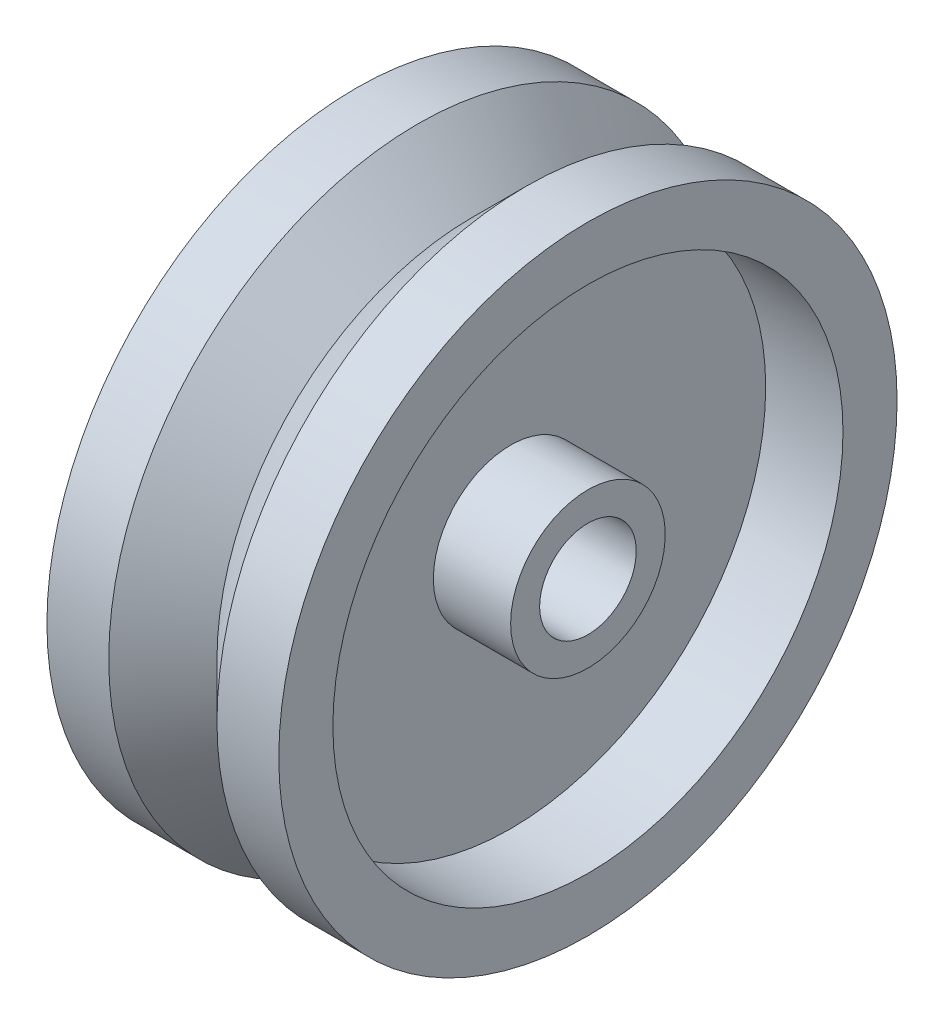
ISO-10303-21;
HEADER;
FILE_DESCRIPTION(('STEP AP214'),'2;1');
FILE_NAME('part.step','',(''),(''),'','','');
FILE_SCHEMA(('AUTOMOTIVE_DESIGN { 1 0 10303 214 1 1 1 1 }'));
ENDSEC;
DATA;
#1=APPLICATION_CONTEXT('core data for automotive mechanical design processes');
#2=APPLICATION_PROTOCOL_DEFINITION('international standard','automotive_design',2000,#1);
#3=PRODUCT_CONTEXT('',#1,'mechanical');
#4=PRODUCT('Part','Part','',(#3));
#5=PRODUCT_RELATED_PRODUCT_CATEGORY('part','',(#4));
#6=PRODUCT_DEFINITION_FORMATION('','',#4);
#7=PRODUCT_DEFINITION_CONTEXT('part definition',#1,'design');
#8=PRODUCT_DEFINITION('design','',#6,#7);
#9=PRODUCT_DEFINITION_SHAPE('','',#8);
#10=(LENGTH_UNIT() NAMED_UNIT(*) SI_UNIT(.MILLI.,.METRE.));
#11=(NAMED_UNIT(*) PLANE_ANGLE_UNIT() SI_UNIT($,.RADIAN.));
#12=(NAMED_UNIT(*) SI_UNIT($,.STERADIAN.) SOLID_ANGLE_UNIT());
#13=UNCERTAINTY_MEASURE_WITH_UNIT(LENGTH_MEASURE(1.E-05),#10,'distance_accuracy_value','');
#14=(GEOMETRIC_REPRESENTATION_CONTEXT(3) GLOBAL_UNCERTAINTY_ASSIGNED_CONTEXT((#13)) GLOBAL_UNIT_ASSIGNED_CONTEXT((#10,
#11,#12)) REPRESENTATION_CONTEXT('',''));
#15=CARTESIAN_POINT('',(0.,0.,0.));
#16=DIRECTION('',(0.,0.,1.));
#17=DIRECTION('',(1.,0.,0.));
#18=AXIS2_PLACEMENT_3D('',#15,#16,#17);
#19=CARTESIAN_POINT('',(0.,0.,6.47515527950311));
#20=DIRECTION('',(-1.,0.,0.));
#21=DIRECTION('',(0.,0.,1.));
#22=AXIS2_PLACEMENT_3D('',#19,#20,#21);
#23=PLANE('',#22);
#24=CARTESIAN_POINT('',(0.,0.,3.35015527950311));
#25=DIRECTION('',(-1.,0.,0.));
#26=DIRECTION('',(0.,0.,1.));
#27=AXIS2_PLACEMENT_3D('',#24,#25,#26);
#28=CIRCLE('',#27,5.);
#29=CARTESIAN_POINT('',(0.,0.,8.35015527950311));
#30=VERTEX_POINT('',#29);
#31=EDGE_CURVE('E10',#30,#30,#28,.T.);
#32=ORIENTED_EDGE('',*,*,#31,.T.);
#33=EDGE_LOOP('',(#32));
#34=FACE_BOUND('',#33,.T.);
#35=CARTESIAN_POINT('',(0.,0.,3.35015527950311));
#36=DIRECTION('',(-1.,0.,0.));
#37=DIRECTION('',(0.,0.,1.));
#38=AXIS2_PLACEMENT_3D('',#35,#36,#37);
#39=CIRCLE('',#38,3.125);
#40=CARTESIAN_POINT('',(0.,0.,6.47515527950311));
#41=VERTEX_POINT('',#40);
#42=EDGE_CURVE('E104',#41,#41,#39,.T.);
#43=ORIENTED_EDGE('',*,*,#42,.F.);
#44=EDGE_LOOP('',(#43));
#45=FACE_BOUND('',#44,.T.);
#46=ADVANCED_FACE('F41',(#34,#45),#23,.T.);
#47=CARTESIAN_POINT('',(-0.838509316770183,0.,3.35015527950311));
#48=DIRECTION('',(-1.,0.,0.));
#49=DIRECTION('',(0.,0.,1.));
#50=AXIS2_PLACEMENT_3D('',#47,#48,#49);
#51=CYLINDRICAL_SURFACE('',#50,5.);
#52=CARTESIAN_POINT('',(5.,0.,3.35015527950311));
#53=DIRECTION('',(-1.,0.,0.));
#54=DIRECTION('',(0.,0.,1.));
#55=AXIS2_PLACEMENT_3D('',#52,#53,#54);
#56=CIRCLE('',#55,5.);
#57=CARTESIAN_POINT('',(5.,0.,8.35015527950311));
#58=VERTEX_POINT('',#57);
#59=EDGE_CURVE('E48',#58,#58,#56,.T.);
#60=ORIENTED_EDGE('',*,*,#59,.T.);
#61=EDGE_LOOP('',(#60));
#62=FACE_BOUND('',#61,.T.);
#63=ORIENTED_EDGE('',*,*,#31,.F.);
#64=EDGE_LOOP('',(#63));
#65=FACE_BOUND('',#64,.T.);
#66=ADVANCED_FACE('F113',(#62,#65),#51,.T.);
#67=CARTESIAN_POINT('',(5.,0.,8.35015527950311));
#68=DIRECTION('',(-1.,0.,0.));
#69=DIRECTION('',(0.,0.,1.));
#70=AXIS2_PLACEMENT_3D('',#67,#68,#69);
#71=PLANE('',#70);
#72=CARTESIAN_POINT('',(5.,0.,3.35015527950311));
#73=DIRECTION('',(-1.,0.,0.));
#74=DIRECTION('',(0.,0.,1.));
#75=AXIS2_PLACEMENT_3D('',#72,#73,#74);
#76=CIRCLE('',#75,16.5);
#77=CARTESIAN_POINT('',(5.,0.,19.8501552795031));
#78=VERTEX_POINT('',#77);
#79=EDGE_CURVE('E53',#78,#78,#76,.T.);
#80=ORIENTED_EDGE('',*,*,#79,.T.);
#81=EDGE_LOOP('',(#80));
#82=FACE_BOUND('',#81,.T.);
#83=ORIENTED_EDGE('',*,*,#59,.F.);
#84=EDGE_LOOP('',(#83));
#85=FACE_BOUND('',#84,.T.);
#86=ADVANCED_FACE('F117',(#82,#85),#71,.T.);
#87=CARTESIAN_POINT('',(-0.838509316770183,0.,3.35015527950311));
#88=DIRECTION('',(-1.,0.,0.));
#89=DIRECTION('',(0.,0.,1.));
#90=AXIS2_PLACEMENT_3D('',#87,#88,#89);
#91=CYLINDRICAL_SURFACE('',#90,16.5);
#92=CARTESIAN_POINT('',(0.,0.,3.35015527950311));
#93=DIRECTION('',(-1.,0.,0.));
#94=DIRECTION('',(0.,0.,1.));
#95=AXIS2_PLACEMENT_3D('',#92,#93,#94);
#96=CIRCLE('',#95,16.5);
#97=CARTESIAN_POINT('',(0.,0.,19.8501552795031));
#98=VERTEX_POINT('',#97);
#99=EDGE_CURVE('E58',#98,#98,#96,.T.);
#100=ORIENTED_EDGE('',*,*,#99,.T.);
#101=EDGE_LOOP('',(#100));
#102=FACE_BOUND('',#101,.T.);
#103=ORIENTED_EDGE('',*,*,#79,.F.);
#104=EDGE_LOOP('',(#103));
#105=FACE_BOUND('',#104,.T.);
#106=ADVANCED_FACE('F121',(#102,#105),#91,.F.);
#107=CARTESIAN_POINT('',(0.,0.,19.8501552795031));
#108=DIRECTION('',(-1.,0.,0.));
#109=DIRECTION('',(0.,0.,1.));
#110=AXIS2_PLACEMENT_3D('',#107,#108,#109);
#111=PLANE('',#110);
#112=CARTESIAN_POINT('',(0.,0.,3.35015527950311));
#113=DIRECTION('',(-1.,0.,0.));
#114=DIRECTION('',(0.,0.,1.));
#115=AXIS2_PLACEMENT_3D('',#112,#113,#114);
#116=CIRCLE('',#115,20.);
#117=CARTESIAN_POINT('',(0.,0.,23.3501552795031));
#118=VERTEX_POINT('',#117);
#119=EDGE_CURVE('E64',#118,#118,#116,.T.);
#120=ORIENTED_EDGE('',*,*,#119,.T.);
#121=EDGE_LOOP('',(#120));
#122=FACE_BOUND('',#121,.T.);
#123=ORIENTED_EDGE('',*,*,#99,.F.);
#124=EDGE_LOOP('',(#123));
#125=FACE_BOUND('',#124,.T.);
#126=ADVANCED_FACE('F128',(#122,#125),#111,.T.);
#127=CARTESIAN_POINT('',(-0.838509316770183,0.,3.35015527950311));
#128=DIRECTION('',(-1.,0.,0.));
#129=DIRECTION('',(0.,0.,1.));
#130=AXIS2_PLACEMENT_3D('',#127,#128,#129);
#131=CYLINDRICAL_SURFACE('',#130,20.);
#132=CARTESIAN_POINT('',(4.00000000000006,0.,3.35015527950311));
#133=DIRECTION('',(-1.,0.,0.));
#134=DIRECTION('',(0.,0.,1.));
#135=AXIS2_PLACEMENT_3D('',#132,#133,#134);
#136=CIRCLE('',#135,20.);
#137=CARTESIAN_POINT('',(4.00000000000006,0.,23.3501552795031));
#138=VERTEX_POINT('',#137);
#139=EDGE_CURVE('E68',#138,#138,#136,.T.);
#140=ORIENTED_EDGE('',*,*,#139,.T.);
#141=EDGE_LOOP('',(#140));
#142=FACE_BOUND('',#141,.T.);
#143=ORIENTED_EDGE('',*,*,#119,.F.);
#144=EDGE_LOOP('',(#143));
#145=FACE_BOUND('',#144,.T.);
#146=ADVANCED_FACE('F132',(#142,#145),#131,.T.);
#147=CARTESIAN_POINT('',(4.00000000000006,0.,3.35015527950311));
#148=DIRECTION('',(-1.,0.,0.));
#149=DIRECTION('',(0.,0.,1.));
#150=AXIS2_PLACEMENT_3D('',#147,#148,#149);
#151=CONICAL_SURFACE('',#150,20.,0.785398163397457);
#152=CARTESIAN_POINT('',(7.5,0.,3.35015527950311));
#153=DIRECTION('',(-1.,0.,0.));
#154=DIRECTION('',(0.,0.,1.));
#155=AXIS2_PLACEMENT_3D('',#152,#153,#154);
#156=CIRCLE('',#155,16.5);
#157=CARTESIAN_POINT('',(7.5,0.,19.8501552795031));
#158=VERTEX_POINT('',#157);
#159=EDGE_CURVE('E72',#158,#158,#156,.T.);
#160=ORIENTED_EDGE('',*,*,#159,.T.);
#161=EDGE_LOOP('',(#160));
#162=FACE_BOUND('',#161,.T.);
#163=ORIENTED_EDGE('',*,*,#139,.F.);
#164=EDGE_LOOP('',(#163));
#165=FACE_BOUND('',#164,.T.);
#166=ADVANCED_FACE('F136',(#162,#165),#151,.T.);
#167=CARTESIAN_POINT('',(7.5,0.,3.35015527950311));
#168=DIRECTION('',(1.,0.,0.));
#169=DIRECTION('',(0.,0.,-1.));
#170=AXIS2_PLACEMENT_3D('',#167,#168,#169);
#171=CONICAL_SURFACE('',#170,16.5,0.785398163397466);
#172=CARTESIAN_POINT('',(10.9999999999999,0.,3.35015527950311));
#173=DIRECTION('',(-1.,0.,0.));
#174=DIRECTION('',(0.,0.,1.));
#175=AXIS2_PLACEMENT_3D('',#172,#173,#174);
#176=CIRCLE('',#175,20.);
#177=CARTESIAN_POINT('',(10.9999999999999,0.,23.3501552795031));
#178=VERTEX_POINT('',#177);
#179=EDGE_CURVE('E76',#178,#178,#176,.T.);
#180=ORIENTED_EDGE('',*,*,#179,.T.);
#181=EDGE_LOOP('',(#180));
#182=FACE_BOUND('',#181,.T.);
#183=ORIENTED_EDGE('',*,*,#159,.F.);
#184=EDGE_LOOP('',(#183));
#185=FACE_BOUND('',#184,.T.);
#186=ADVANCED_FACE('F140',(#182,#185),#171,.T.);
#187=CARTESIAN_POINT('',(-0.838509316770183,0.,3.35015527950311));
#188=DIRECTION('',(-1.,0.,0.));
#189=DIRECTION('',(0.,0.,1.));
#190=AXIS2_PLACEMENT_3D('',#187,#188,#189);
#191=CYLINDRICAL_SURFACE('',#190,20.);
#192=CARTESIAN_POINT('',(15.,0.,3.35015527950311));
#193=DIRECTION('',(-1.,0.,0.));
#194=DIRECTION('',(0.,0.,1.));
#195=AXIS2_PLACEMENT_3D('',#192,#193,#194);
#196=CIRCLE('',#195,20.);
#197=CARTESIAN_POINT('',(15.,0.,23.3501552795031));
#198=VERTEX_POINT('',#197);
#199=EDGE_CURVE('E80',#198,#198,#196,.T.);
#200=ORIENTED_EDGE('',*,*,#199,.T.);
#201=EDGE_LOOP('',(#200));
#202=FACE_BOUND('',#201,.T.);
#203=ORIENTED_EDGE('',*,*,#179,.F.);
#204=EDGE_LOOP('',(#203));
#205=FACE_BOUND('',#204,.T.);
#206=ADVANCED_FACE('F144',(#202,#205),#191,.T.);
#207=CARTESIAN_POINT('',(15.,0.,19.8501552795031));
#208=DIRECTION('',(1.,0.,0.));
#209=DIRECTION('',(0.,0.,-1.));
#210=AXIS2_PLACEMENT_3D('',#207,#208,#209);
#211=PLANE('',#210);
#212=CARTESIAN_POINT('',(15.,0.,3.35015527950311));
#213=DIRECTION('',(-1.,0.,0.));
#214=DIRECTION('',(0.,0.,1.));
#215=AXIS2_PLACEMENT_3D('',#212,#213,#214);
#216=CIRCLE('',#215,16.5);
#217=CARTESIAN_POINT('',(15.,0.,19.8501552795031));
#218=VERTEX_POINT('',#217);
#219=EDGE_CURVE('E84',#218,#218,#216,.T.);
#220=ORIENTED_EDGE('',*,*,#219,.T.);
#221=EDGE_LOOP('',(#220));
#222=FACE_BOUND('',#221,.T.);
#223=ORIENTED_EDGE('',*,*,#199,.F.);
#224=EDGE_LOOP('',(#223));
#225=FACE_BOUND('',#224,.T.);
#226=ADVANCED_FACE('F148',(#222,#225),#211,.T.);
#227=CARTESIAN_POINT('',(-0.838509316770183,0.,3.35015527950311));
#228=DIRECTION('',(-1.,0.,0.));
#229=DIRECTION('',(0.,0.,1.));
#230=AXIS2_PLACEMENT_3D('',#227,#228,#229);
#231=CYLINDRICAL_SURFACE('',#230,16.5);
#232=CARTESIAN_POINT('',(10.,0.,3.35015527950311));
#233=DIRECTION('',(-1.,0.,0.));
#234=DIRECTION('',(0.,0.,1.));
#235=AXIS2_PLACEMENT_3D('',#232,#233,#234);
#236=CIRCLE('',#235,16.5);
#237=CARTESIAN_POINT('',(10.,0.,19.8501552795031));
#238=VERTEX_POINT('',#237);
#239=EDGE_CURVE('E88',#238,#238,#236,.T.);
#240=ORIENTED_EDGE('',*,*,#239,.T.);
#241=EDGE_LOOP('',(#240));
#242=FACE_BOUND('',#241,.T.);
#243=ORIENTED_EDGE('',*,*,#219,.F.);
#244=EDGE_LOOP('',(#243));
#245=FACE_BOUND('',#244,.T.);
#246=ADVANCED_FACE('F152',(#242,#245),#231,.F.);
#247=CARTESIAN_POINT('',(10.,0.,8.35015527950311));
#248=DIRECTION('',(1.,0.,0.));
#249=DIRECTION('',(0.,0.,-1.));
#250=AXIS2_PLACEMENT_3D('',#247,#248,#249);
#251=PLANE('',#250);
#252=CARTESIAN_POINT('',(10.,0.,3.35015527950311));
#253=DIRECTION('',(-1.,0.,0.));
#254=DIRECTION('',(0.,0.,1.));
#255=AXIS2_PLACEMENT_3D('',#252,#253,#254);
#256=CIRCLE('',#255,5.);
#257=CARTESIAN_POINT('',(10.,0.,8.35015527950311));
#258=VERTEX_POINT('',#257);
#259=EDGE_CURVE('E92',#258,#258,#256,.T.);
#260=ORIENTED_EDGE('',*,*,#259,.T.);
#261=EDGE_LOOP('',(#260));
#262=FACE_BOUND('',#261,.T.);
#263=ORIENTED_EDGE('',*,*,#239,.F.);
#264=EDGE_LOOP('',(#263));
#265=FACE_BOUND('',#264,.T.);
#266=ADVANCED_FACE('F156',(#262,#265),#251,.T.);
#267=CARTESIAN_POINT('',(-0.838509316770183,0.,3.35015527950311));
#268=DIRECTION('',(-1.,0.,0.));
#269=DIRECTION('',(0.,0.,1.));
#270=AXIS2_PLACEMENT_3D('',#267,#268,#269);
#271=CYLINDRICAL_SURFACE('',#270,5.);
#272=CARTESIAN_POINT('',(15.,0.,3.35015527950311));
#273=DIRECTION('',(-1.,0.,0.));
#274=DIRECTION('',(0.,0.,1.));
#275=AXIS2_PLACEMENT_3D('',#272,#273,#274);
#276=CIRCLE('',#275,5.);
#277=CARTESIAN_POINT('',(15.,0.,8.35015527950311));
#278=VERTEX_POINT('',#277);
#279=EDGE_CURVE('E96',#278,#278,#276,.T.);
#280=ORIENTED_EDGE('',*,*,#279,.T.);
#281=EDGE_LOOP('',(#280));
#282=FACE_BOUND('',#281,.T.);
#283=ORIENTED_EDGE('',*,*,#259,.F.);
#284=EDGE_LOOP('',(#283));
#285=FACE_BOUND('',#284,.T.);
#286=ADVANCED_FACE('F160',(#282,#285),#271,.T.);
#287=CARTESIAN_POINT('',(15.,0.,6.47515527950311));
#288=DIRECTION('',(1.,0.,0.));
#289=DIRECTION('',(0.,0.,-1.));
#290=AXIS2_PLACEMENT_3D('',#287,#288,#289);
#291=PLANE('',#290);
#292=CARTESIAN_POINT('',(15.,0.,3.35015527950311));
#293=DIRECTION('',(-1.,0.,0.));
#294=DIRECTION('',(0.,0.,1.));
#295=AXIS2_PLACEMENT_3D('',#292,#293,#294);
#296=CIRCLE('',#295,3.125);
#297=CARTESIAN_POINT('',(15.,0.,6.47515527950311));
#298=VERTEX_POINT('',#297);
#299=EDGE_CURVE('E100',#298,#298,#296,.T.);
#300=ORIENTED_EDGE('',*,*,#299,.T.);
#301=EDGE_LOOP('',(#300));
#302=FACE_BOUND('',#301,.T.);
#303=ORIENTED_EDGE('',*,*,#279,.F.);
#304=EDGE_LOOP('',(#303));
#305=FACE_BOUND('',#304,.T.);
#306=ADVANCED_FACE('F164',(#302,#305),#291,.T.);
#307=CARTESIAN_POINT('',(-0.838509316770183,0.,3.35015527950311));
#308=DIRECTION('',(-1.,0.,0.));
#309=DIRECTION('',(0.,0.,1.));
#310=AXIS2_PLACEMENT_3D('',#307,#308,#309);
#311=CYLINDRICAL_SURFACE('',#310,3.125);
#312=ORIENTED_EDGE('',*,*,#42,.T.);
#313=EDGE_LOOP('',(#312));
#314=FACE_BOUND('',#313,.T.);
#315=ORIENTED_EDGE('',*,*,#299,.F.);
#316=EDGE_LOOP('',(#315));
#317=FACE_BOUND('',#316,.T.);
#318=ADVANCED_FACE('F109',(#314,#317),#311,.F.);
#319=CLOSED_SHELL('',(#46,#66,#86,#106,#126,#146,#166,#186,#206,#226,#246,#266,#286,#306,#318));
#320=MANIFOLD_SOLID_BREP('B2',#319);
#321=ADVANCED_BREP_SHAPE_REPRESENTATION('',(#18,#320),#14);
#322=SHAPE_DEFINITION_REPRESENTATION(#9,#321);
ENDSEC;
END-ISO-10303-21;
